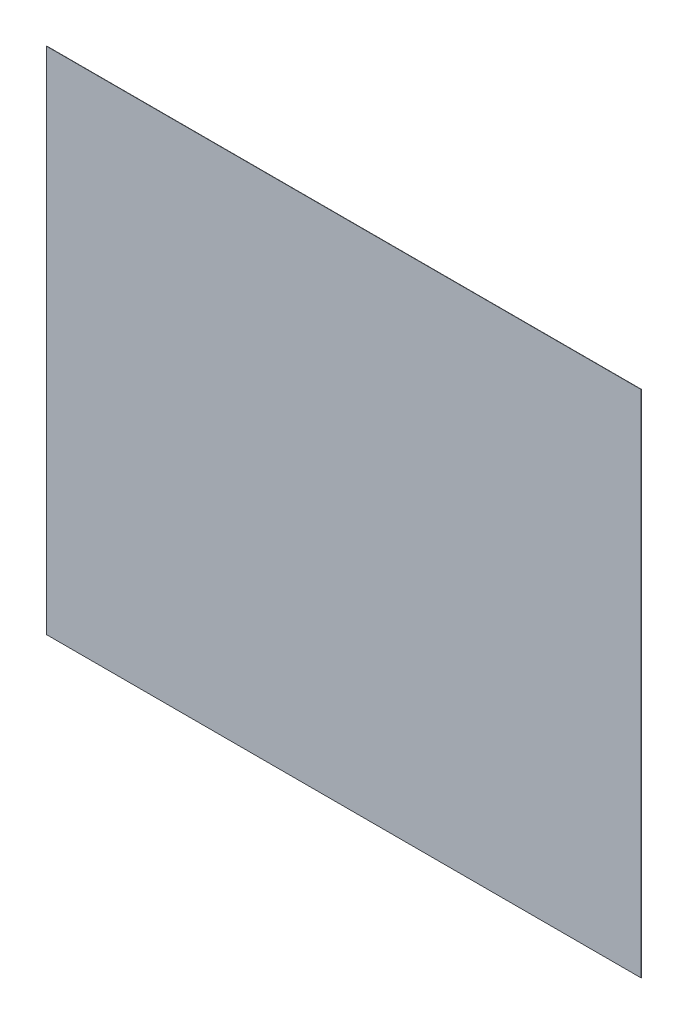
ISO-10303-21;
HEADER;
FILE_DESCRIPTION(('STEP AP214'),'2;1');
FILE_NAME('part.step','',(''),(''),'','','');
FILE_SCHEMA(('AUTOMOTIVE_DESIGN { 1 0 10303 214 1 1 1 1 }'));
ENDSEC;
DATA;
#1=APPLICATION_CONTEXT('core data for automotive mechanical design processes');
#2=APPLICATION_PROTOCOL_DEFINITION('international standard','automotive_design',2000,#1);
#3=PRODUCT_CONTEXT('',#1,'mechanical');
#4=PRODUCT('Part','Part','',(#3));
#5=PRODUCT_RELATED_PRODUCT_CATEGORY('part','',(#4));
#6=PRODUCT_DEFINITION_FORMATION('','',#4);
#7=PRODUCT_DEFINITION_CONTEXT('part definition',#1,'design');
#8=PRODUCT_DEFINITION('design','',#6,#7);
#9=PRODUCT_DEFINITION_SHAPE('','',#8);
#10=(LENGTH_UNIT() NAMED_UNIT(*) SI_UNIT(.MILLI.,.METRE.));
#11=(NAMED_UNIT(*) PLANE_ANGLE_UNIT() SI_UNIT($,.RADIAN.));
#12=(NAMED_UNIT(*) SI_UNIT($,.STERADIAN.) SOLID_ANGLE_UNIT());
#13=UNCERTAINTY_MEASURE_WITH_UNIT(LENGTH_MEASURE(1.E-05),#10,'distance_accuracy_value','');
#14=(GEOMETRIC_REPRESENTATION_CONTEXT(3) GLOBAL_UNCERTAINTY_ASSIGNED_CONTEXT((#13)) GLOBAL_UNIT_ASSIGNED_CONTEXT((#10,
#11,#12)) REPRESENTATION_CONTEXT('',''));
#15=CARTESIAN_POINT('',(0.,0.,0.));
#16=DIRECTION('',(0.,0.,1.));
#17=DIRECTION('',(1.,0.,0.));
#18=AXIS2_PLACEMENT_3D('',#15,#16,#17);
#19=CARTESIAN_POINT('',(0.,0.,0.));
#20=DIRECTION('',(0.,0.,1.));
#21=DIRECTION('',(1.,0.,0.));
#22=AXIS2_PLACEMENT_3D('',#19,#20,#21);
#23=PLANE('',#22);
#24=DIRECTION('',(1.,0.,0.));
#25=VECTOR('',#24,1.);
#26=CARTESIAN_POINT('',(-53.1,-45.5,0.));
#27=LINE('',#26,#25);
#28=CARTESIAN_POINT('',(-53.1,-45.5,0.));
#29=VERTEX_POINT('',#28);
#30=CARTESIAN_POINT('',(53.1,-45.5,0.));
#31=VERTEX_POINT('',#30);
#32=EDGE_CURVE('E27',#29,#31,#27,.T.);
#33=ORIENTED_EDGE('',*,*,#32,.F.);
#34=DIRECTION('',(0.,-1.,0.));
#35=VECTOR('',#34,1.);
#36=CARTESIAN_POINT('',(-53.1,45.5,0.));
#37=LINE('',#36,#35);
#38=CARTESIAN_POINT('',(-53.1,45.5,0.));
#39=VERTEX_POINT('',#38);
#40=EDGE_CURVE('E93',#39,#29,#37,.T.);
#41=ORIENTED_EDGE('',*,*,#40,.F.);
#42=DIRECTION('',(-1.,0.,0.));
#43=VECTOR('',#42,1.);
#44=CARTESIAN_POINT('',(53.1,45.5,0.));
#45=LINE('',#44,#43);
#46=CARTESIAN_POINT('',(53.1,45.5,0.));
#47=VERTEX_POINT('',#46);
#48=EDGE_CURVE('E56',#47,#39,#45,.T.);
#49=ORIENTED_EDGE('',*,*,#48,.F.);
#50=DIRECTION('',(0.,1.,0.));
#51=VECTOR('',#50,1.);
#52=CARTESIAN_POINT('',(53.1,-45.5,0.));
#53=LINE('',#52,#51);
#54=EDGE_CURVE('E81',#31,#47,#53,.T.);
#55=ORIENTED_EDGE('',*,*,#54,.F.);
#56=EDGE_LOOP('',(#33,#41,#49,#55));
#57=FACE_BOUND('',#56,.T.);
#58=ADVANCED_FACE('F16',(#57),#23,.F.);
#59=CARTESIAN_POINT('',(0.,0.,0.05));
#60=DIRECTION('',(0.,0.,1.));
#61=DIRECTION('',(1.,0.,0.));
#62=AXIS2_PLACEMENT_3D('',#59,#60,#61);
#63=PLANE('',#62);
#64=DIRECTION('',(1.,0.,0.));
#65=VECTOR('',#64,1.);
#66=CARTESIAN_POINT('',(-53.1,-45.5,0.05));
#67=LINE('',#66,#65);
#68=CARTESIAN_POINT('',(-53.1,-45.5,0.05));
#69=VERTEX_POINT('',#68);
#70=CARTESIAN_POINT('',(53.1,-45.5,0.05));
#71=VERTEX_POINT('',#70);
#72=EDGE_CURVE('E11',#69,#71,#67,.T.);
#73=ORIENTED_EDGE('',*,*,#72,.T.);
#74=DIRECTION('',(0.,1.,0.));
#75=VECTOR('',#74,1.);
#76=CARTESIAN_POINT('',(53.1,-45.5,0.05));
#77=LINE('',#76,#75);
#78=CARTESIAN_POINT('',(53.1,45.5,0.05));
#79=VERTEX_POINT('',#78);
#80=EDGE_CURVE('E75',#71,#79,#77,.T.);
#81=ORIENTED_EDGE('',*,*,#80,.T.);
#82=DIRECTION('',(-1.,0.,0.));
#83=VECTOR('',#82,1.);
#84=CARTESIAN_POINT('',(53.1,45.5,0.05));
#85=LINE('',#84,#83);
#86=CARTESIAN_POINT('',(-53.1,45.5,0.05));
#87=VERTEX_POINT('',#86);
#88=EDGE_CURVE('E89',#79,#87,#85,.T.);
#89=ORIENTED_EDGE('',*,*,#88,.T.);
#90=DIRECTION('',(0.,-1.,0.));
#91=VECTOR('',#90,1.);
#92=CARTESIAN_POINT('',(-53.1,45.5,0.05));
#93=LINE('',#92,#91);
#94=EDGE_CURVE('E20',#87,#69,#93,.T.);
#95=ORIENTED_EDGE('',*,*,#94,.T.);
#96=EDGE_LOOP('',(#73,#81,#89,#95));
#97=FACE_BOUND('',#96,.T.);
#98=ADVANCED_FACE('F124',(#97),#63,.T.);
#99=CARTESIAN_POINT('',(-53.1,-45.5,0.));
#100=DIRECTION('',(0.,-1.,0.));
#101=DIRECTION('',(0.,0.,-1.));
#102=AXIS2_PLACEMENT_3D('',#99,#100,#101);
#103=PLANE('',#102);
#104=ORIENTED_EDGE('',*,*,#32,.T.);
#105=DIRECTION('',(0.,0.,1.));
#106=VECTOR('',#105,1.);
#107=CARTESIAN_POINT('',(53.1,-45.5,0.));
#108=LINE('',#107,#106);
#109=EDGE_CURVE('E85',#31,#71,#108,.T.);
#110=ORIENTED_EDGE('',*,*,#109,.T.);
#111=ORIENTED_EDGE('',*,*,#72,.F.);
#112=DIRECTION('',(0.,0.,1.));
#113=VECTOR('',#112,1.);
#114=CARTESIAN_POINT('',(-53.1,-45.5,0.));
#115=LINE('',#114,#113);
#116=EDGE_CURVE('E106',#29,#69,#115,.T.);
#117=ORIENTED_EDGE('',*,*,#116,.F.);
#118=EDGE_LOOP('',(#104,#110,#111,#117));
#119=FACE_BOUND('',#118,.T.);
#120=ADVANCED_FACE('F119',(#119),#103,.T.);
#121=CARTESIAN_POINT('',(53.1,-45.5,0.));
#122=DIRECTION('',(1.,0.,0.));
#123=DIRECTION('',(0.,1.,0.));
#124=AXIS2_PLACEMENT_3D('',#121,#122,#123);
#125=PLANE('',#124);
#126=ORIENTED_EDGE('',*,*,#54,.T.);
#127=DIRECTION('',(0.,0.,1.));
#128=VECTOR('',#127,1.);
#129=CARTESIAN_POINT('',(53.1,45.5,0.));
#130=LINE('',#129,#128);
#131=EDGE_CURVE('E83',#47,#79,#130,.T.);
#132=ORIENTED_EDGE('',*,*,#131,.T.);
#133=ORIENTED_EDGE('',*,*,#80,.F.);
#134=ORIENTED_EDGE('',*,*,#109,.F.);
#135=EDGE_LOOP('',(#126,#132,#133,#134));
#136=FACE_BOUND('',#135,.T.);
#137=ADVANCED_FACE('F82',(#136),#125,.T.);
#138=CARTESIAN_POINT('',(53.1,45.5,0.));
#139=DIRECTION('',(0.,1.,0.));
#140=DIRECTION('',(1.,0.,0.));
#141=AXIS2_PLACEMENT_3D('',#138,#139,#140);
#142=PLANE('',#141);
#143=ORIENTED_EDGE('',*,*,#48,.T.);
#144=DIRECTION('',(0.,0.,1.));
#145=VECTOR('',#144,1.);
#146=CARTESIAN_POINT('',(-53.1,45.5,0.));
#147=LINE('',#146,#145);
#148=EDGE_CURVE('E95',#39,#87,#147,.T.);
#149=ORIENTED_EDGE('',*,*,#148,.T.);
#150=ORIENTED_EDGE('',*,*,#88,.F.);
#151=ORIENTED_EDGE('',*,*,#131,.F.);
#152=EDGE_LOOP('',(#143,#149,#150,#151));
#153=FACE_BOUND('',#152,.T.);
#154=ADVANCED_FACE('F88',(#153),#142,.T.);
#155=CARTESIAN_POINT('',(-53.1,45.5,0.));
#156=DIRECTION('',(-1.,0.,0.));
#157=DIRECTION('',(0.,1.,0.));
#158=AXIS2_PLACEMENT_3D('',#155,#156,#157);
#159=PLANE('',#158);
#160=ORIENTED_EDGE('',*,*,#40,.T.);
#161=ORIENTED_EDGE('',*,*,#116,.T.);
#162=ORIENTED_EDGE('',*,*,#94,.F.);
#163=ORIENTED_EDGE('',*,*,#148,.F.);
#164=EDGE_LOOP('',(#160,#161,#162,#163));
#165=FACE_BOUND('',#164,.T.);
#166=ADVANCED_FACE('F18',(#165),#159,.T.);
#167=CLOSED_SHELL('',(#58,#98,#120,#137,#154,#166));
#168=MANIFOLD_SOLID_BREP('B1',#167);
#169=ADVANCED_BREP_SHAPE_REPRESENTATION('',(#18,#168),#14);
#170=SHAPE_DEFINITION_REPRESENTATION(#9,#169);
ENDSEC;
END-ISO-10303-21;
